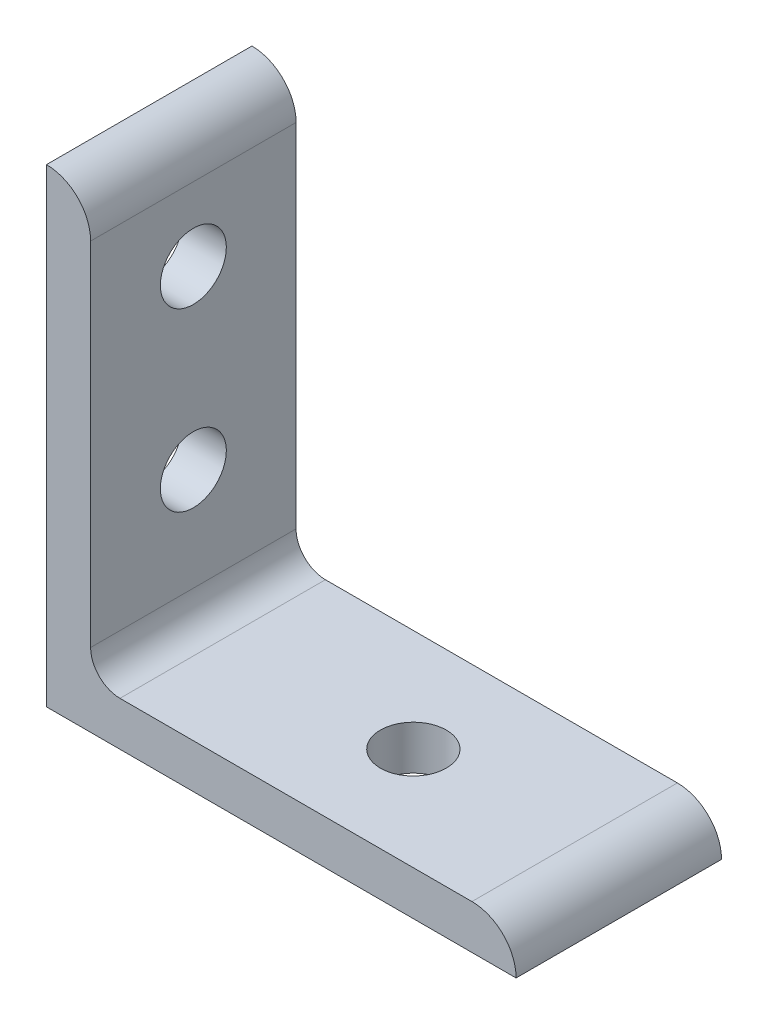
ISO-10303-21;
HEADER;
FILE_DESCRIPTION(('STEP AP214'),'2;1');
FILE_NAME('part.step','',(''),(''),'','','');
FILE_SCHEMA(('AUTOMOTIVE_DESIGN { 1 0 10303 214 1 1 1 1 }'));
ENDSEC;
DATA;
#1=APPLICATION_CONTEXT('core data for automotive mechanical design processes');
#2=APPLICATION_PROTOCOL_DEFINITION('international standard','automotive_design',2000,#1);
#3=PRODUCT_CONTEXT('',#1,'mechanical');
#4=PRODUCT('Part','Part','',(#3));
#5=PRODUCT_RELATED_PRODUCT_CATEGORY('part','',(#4));
#6=PRODUCT_DEFINITION_FORMATION('','',#4);
#7=PRODUCT_DEFINITION_CONTEXT('part definition',#1,'design');
#8=PRODUCT_DEFINITION('design','',#6,#7);
#9=PRODUCT_DEFINITION_SHAPE('','',#8);
#10=(LENGTH_UNIT() NAMED_UNIT(*) SI_UNIT(.MILLI.,.METRE.));
#11=(NAMED_UNIT(*) PLANE_ANGLE_UNIT() SI_UNIT($,.RADIAN.));
#12=(NAMED_UNIT(*) SI_UNIT($,.STERADIAN.) SOLID_ANGLE_UNIT());
#13=UNCERTAINTY_MEASURE_WITH_UNIT(LENGTH_MEASURE(1.E-05),#10,'distance_accuracy_value','');
#14=(GEOMETRIC_REPRESENTATION_CONTEXT(3) GLOBAL_UNCERTAINTY_ASSIGNED_CONTEXT((#13)) GLOBAL_UNIT_ASSIGNED_CONTEXT((#10,
#11,#12)) REPRESENTATION_CONTEXT('',''));
#15=CARTESIAN_POINT('',(0.,0.,0.));
#16=DIRECTION('',(0.,0.,1.));
#17=DIRECTION('',(1.,0.,0.));
#18=AXIS2_PLACEMENT_3D('',#15,#16,#17);
#19=CARTESIAN_POINT('',(4.7752,46.0248,11.1125));
#20=DIRECTION('',(-1.,0.,0.));
#21=DIRECTION('',(0.,-1.,0.));
#22=AXIS2_PLACEMENT_3D('',#19,#20,#21);
#23=PLANE('',#22);
#24=DIRECTION('',(0.,1.,0.));
#25=VECTOR('',#24,1.);
#26=CARTESIAN_POINT('',(4.7752,46.0248,-11.1125));
#27=LINE('',#26,#25);
#28=CARTESIAN_POINT('',(4.7752,7.9502,-11.1125));
#29=VERTEX_POINT('',#28);
#30=CARTESIAN_POINT('',(4.77519999999999,46.0248,-11.1125));
#31=VERTEX_POINT('',#30);
#32=EDGE_CURVE('E118',#29,#31,#27,.T.);
#33=ORIENTED_EDGE('',*,*,#32,.T.);
#34=DIRECTION('',(0.,0.,-1.));
#35=VECTOR('',#34,1.);
#36=CARTESIAN_POINT('',(4.77519999999999,46.0248,11.1125));
#37=LINE('',#36,#35);
#38=CARTESIAN_POINT('',(4.77519999999999,46.0248,11.1125));
#39=VERTEX_POINT('',#38);
#40=EDGE_CURVE('E115',#39,#31,#37,.T.);
#41=ORIENTED_EDGE('',*,*,#40,.F.);
#42=DIRECTION('',(0.,1.,0.));
#43=VECTOR('',#42,1.);
#44=CARTESIAN_POINT('',(4.7752,46.0248,11.1125));
#45=LINE('',#44,#43);
#46=CARTESIAN_POINT('',(4.7752,7.9502,11.1125));
#47=VERTEX_POINT('',#46);
#48=EDGE_CURVE('E104',#47,#39,#45,.T.);
#49=ORIENTED_EDGE('',*,*,#48,.F.);
#50=DIRECTION('',(0.,0.,-1.));
#51=VECTOR('',#50,1.);
#52=CARTESIAN_POINT('',(4.7752,7.9502,11.1125));
#53=LINE('',#52,#51);
#54=EDGE_CURVE('E119',#47,#29,#53,.T.);
#55=ORIENTED_EDGE('',*,*,#54,.T.);
#56=EDGE_LOOP('',(#33,#41,#49,#55));
#57=FACE_BOUND('',#56,.T.);
#58=CARTESIAN_POINT('',(4.7752,19.05,0.));
#59=DIRECTION('',(-1.,0.,0.));
#60=DIRECTION('',(0.,-1.,0.));
#61=AXIS2_PLACEMENT_3D('',#58,#59,#60);
#62=CIRCLE('',#61,3.5687);
#63=CARTESIAN_POINT('',(4.7752,15.4813,0.));
#64=VERTEX_POINT('',#63);
#65=EDGE_CURVE('E168',#64,#64,#62,.F.);
#66=ORIENTED_EDGE('',*,*,#65,.F.);
#67=EDGE_LOOP('',(#66));
#68=FACE_BOUND('',#67,.T.);
#69=CARTESIAN_POINT('',(4.77519999999999,38.1,0.));
#70=DIRECTION('',(-1.,0.,0.));
#71=DIRECTION('',(0.,-1.,0.));
#72=AXIS2_PLACEMENT_3D('',#69,#70,#71);
#73=CIRCLE('',#72,3.5687);
#74=CARTESIAN_POINT('',(4.77519999999999,34.5313,0.));
#75=VERTEX_POINT('',#74);
#76=EDGE_CURVE('E174',#75,#75,#73,.F.);
#77=ORIENTED_EDGE('',*,*,#76,.F.);
#78=EDGE_LOOP('',(#77));
#79=FACE_BOUND('',#78,.T.);
#80=ADVANCED_FACE('F36',(#57,#68,#79),#23,.F.);
#81=CARTESIAN_POINT('',(0.,0.,11.1125));
#82=DIRECTION('',(1.,0.,0.));
#83=DIRECTION('',(0.,0.,-1.));
#84=AXIS2_PLACEMENT_3D('',#81,#82,#83);
#85=PLANE('',#84);
#86=DIRECTION('',(0.,-1.,0.));
#87=VECTOR('',#86,1.);
#88=CARTESIAN_POINT('',(0.,0.,-11.1125));
#89=LINE('',#88,#87);
#90=CARTESIAN_POINT('',(0.,50.8,-11.1125));
#91=VERTEX_POINT('',#90);
#92=CARTESIAN_POINT('',(0.,0.,-11.1125));
#93=VERTEX_POINT('',#92);
#94=EDGE_CURVE('E86',#91,#93,#89,.T.);
#95=ORIENTED_EDGE('',*,*,#94,.T.);
#96=DIRECTION('',(0.,0.,-1.));
#97=VECTOR('',#96,1.);
#98=CARTESIAN_POINT('',(0.,0.,11.1125));
#99=LINE('',#98,#97);
#100=CARTESIAN_POINT('',(0.,0.,11.1125));
#101=VERTEX_POINT('',#100);
#102=EDGE_CURVE('E124',#101,#93,#99,.T.);
#103=ORIENTED_EDGE('',*,*,#102,.F.);
#104=DIRECTION('',(0.,-1.,0.));
#105=VECTOR('',#104,1.);
#106=CARTESIAN_POINT('',(0.,0.,11.1125));
#107=LINE('',#106,#105);
#108=CARTESIAN_POINT('',(0.,50.8,11.1125));
#109=VERTEX_POINT('',#108);
#110=EDGE_CURVE('E54',#109,#101,#107,.T.);
#111=ORIENTED_EDGE('',*,*,#110,.F.);
#112=DIRECTION('',(0.,0.,-1.));
#113=VECTOR('',#112,1.);
#114=CARTESIAN_POINT('',(0.,50.8,11.1125));
#115=LINE('',#114,#113);
#116=EDGE_CURVE('E120',#109,#91,#115,.T.);
#117=ORIENTED_EDGE('',*,*,#116,.T.);
#118=EDGE_LOOP('',(#95,#103,#111,#117));
#119=FACE_BOUND('',#118,.T.);
#120=CARTESIAN_POINT('',(0.,19.05,0.));
#121=DIRECTION('',(1.,0.,0.));
#122=DIRECTION('',(0.,0.,-1.));
#123=AXIS2_PLACEMENT_3D('',#120,#121,#122);
#124=CIRCLE('',#123,3.5687);
#125=CARTESIAN_POINT('',(0.,19.05,-3.5687));
#126=VERTEX_POINT('',#125);
#127=EDGE_CURVE('E171',#126,#126,#124,.T.);
#128=ORIENTED_EDGE('',*,*,#127,.T.);
#129=EDGE_LOOP('',(#128));
#130=FACE_BOUND('',#129,.T.);
#131=CARTESIAN_POINT('',(0.,38.1,0.));
#132=DIRECTION('',(1.,0.,0.));
#133=DIRECTION('',(0.,0.,-1.));
#134=AXIS2_PLACEMENT_3D('',#131,#132,#133);
#135=CIRCLE('',#134,3.5687);
#136=CARTESIAN_POINT('',(0.,38.1,-3.5687));
#137=VERTEX_POINT('',#136);
#138=EDGE_CURVE('E177',#137,#137,#135,.T.);
#139=ORIENTED_EDGE('',*,*,#138,.T.);
#140=EDGE_LOOP('',(#139));
#141=FACE_BOUND('',#140,.T.);
#142=ADVANCED_FACE('F181',(#119,#130,#141),#85,.F.);
#143=CARTESIAN_POINT('',(50.8,0.,11.1125));
#144=DIRECTION('',(0.,1.,0.));
#145=DIRECTION('',(-1.,0.,0.));
#146=AXIS2_PLACEMENT_3D('',#143,#144,#145);
#147=PLANE('',#146);
#148=DIRECTION('',(1.,0.,0.));
#149=VECTOR('',#148,1.);
#150=CARTESIAN_POINT('',(50.8,0.,-11.1125));
#151=LINE('',#150,#149);
#152=CARTESIAN_POINT('',(50.8,0.,-11.1125));
#153=VERTEX_POINT('',#152);
#154=EDGE_CURVE('E128',#93,#153,#151,.T.);
#155=ORIENTED_EDGE('',*,*,#154,.T.);
#156=DIRECTION('',(0.,0.,-1.));
#157=VECTOR('',#156,1.);
#158=CARTESIAN_POINT('',(50.8,0.,11.1125));
#159=LINE('',#158,#157);
#160=CARTESIAN_POINT('',(50.8,0.,11.1125));
#161=VERTEX_POINT('',#160);
#162=EDGE_CURVE('E11',#161,#153,#159,.T.);
#163=ORIENTED_EDGE('',*,*,#162,.F.);
#164=DIRECTION('',(1.,0.,0.));
#165=VECTOR('',#164,1.);
#166=CARTESIAN_POINT('',(50.8,0.,11.1125));
#167=LINE('',#166,#165);
#168=EDGE_CURVE('E140',#101,#161,#167,.T.);
#169=ORIENTED_EDGE('',*,*,#168,.F.);
#170=ORIENTED_EDGE('',*,*,#102,.T.);
#171=EDGE_LOOP('',(#155,#163,#169,#170));
#172=FACE_BOUND('',#171,.T.);
#173=CARTESIAN_POINT('',(28.575,0.,0.));
#174=DIRECTION('',(0.,1.,0.));
#175=DIRECTION('',(0.,0.,1.));
#176=AXIS2_PLACEMENT_3D('',#173,#174,#175);
#177=CIRCLE('',#176,3.5687);
#178=CARTESIAN_POINT('',(28.575,0.,3.5687));
#179=VERTEX_POINT('',#178);
#180=EDGE_CURVE('E165',#179,#179,#177,.T.);
#181=ORIENTED_EDGE('',*,*,#180,.T.);
#182=EDGE_LOOP('',(#181));
#183=FACE_BOUND('',#182,.T.);
#184=ADVANCED_FACE('F38',(#172,#183),#147,.F.);
#185=CARTESIAN_POINT('',(7.9502,4.7752,11.1125));
#186=DIRECTION('',(0.,-1.,0.));
#187=DIRECTION('',(1.,0.,0.));
#188=AXIS2_PLACEMENT_3D('',#185,#186,#187);
#189=PLANE('',#188);
#190=DIRECTION('',(-1.,0.,0.));
#191=VECTOR('',#190,1.);
#192=CARTESIAN_POINT('',(7.9502,4.7752,-11.1125));
#193=LINE('',#192,#191);
#194=CARTESIAN_POINT('',(46.0248,4.7752,-11.1125));
#195=VERTEX_POINT('',#194);
#196=CARTESIAN_POINT('',(7.9502,4.7752,-11.1125));
#197=VERTEX_POINT('',#196);
#198=EDGE_CURVE('E133',#195,#197,#193,.T.);
#199=ORIENTED_EDGE('',*,*,#198,.T.);
#200=DIRECTION('',(0.,0.,-1.));
#201=VECTOR('',#200,1.);
#202=CARTESIAN_POINT('',(7.9502,4.7752,11.1125));
#203=LINE('',#202,#201);
#204=CARTESIAN_POINT('',(7.9502,4.7752,11.1125));
#205=VERTEX_POINT('',#204);
#206=EDGE_CURVE('E144',#205,#197,#203,.T.);
#207=ORIENTED_EDGE('',*,*,#206,.F.);
#208=DIRECTION('',(-1.,0.,0.));
#209=VECTOR('',#208,1.);
#210=CARTESIAN_POINT('',(7.9502,4.7752,11.1125));
#211=LINE('',#210,#209);
#212=CARTESIAN_POINT('',(46.0248,4.7752,11.1125));
#213=VERTEX_POINT('',#212);
#214=EDGE_CURVE('E154',#213,#205,#211,.T.);
#215=ORIENTED_EDGE('',*,*,#214,.F.);
#216=DIRECTION('',(0.,0.,-1.));
#217=VECTOR('',#216,1.);
#218=CARTESIAN_POINT('',(46.0248,4.7752,11.1125));
#219=LINE('',#218,#217);
#220=EDGE_CURVE('E46',#213,#195,#219,.T.);
#221=ORIENTED_EDGE('',*,*,#220,.T.);
#222=EDGE_LOOP('',(#199,#207,#215,#221));
#223=FACE_BOUND('',#222,.T.);
#224=CARTESIAN_POINT('',(28.575,4.7752,0.));
#225=DIRECTION('',(0.,-1.,0.));
#226=DIRECTION('',(1.,0.,0.));
#227=AXIS2_PLACEMENT_3D('',#224,#225,#226);
#228=CIRCLE('',#227,3.5687);
#229=CARTESIAN_POINT('',(32.1437,4.7752,0.));
#230=VERTEX_POINT('',#229);
#231=EDGE_CURVE('E40',#230,#230,#228,.F.);
#232=ORIENTED_EDGE('',*,*,#231,.F.);
#233=EDGE_LOOP('',(#232));
#234=FACE_BOUND('',#233,.T.);
#235=ADVANCED_FACE('F151',(#223,#234),#189,.F.);
#236=CARTESIAN_POINT('',(46.0248,0.,11.1125));
#237=DIRECTION('',(0.,0.,-1.));
#238=DIRECTION('',(-1.,0.,0.));
#239=AXIS2_PLACEMENT_3D('',#236,#237,#238);
#240=CYLINDRICAL_SURFACE('',#239,4.7752);
#241=CARTESIAN_POINT('',(46.0248,0.,-11.1125));
#242=DIRECTION('',(0.,0.,1.));
#243=DIRECTION('',(1.,0.,0.));
#244=AXIS2_PLACEMENT_3D('',#241,#242,#243);
#245=CIRCLE('',#244,4.7752);
#246=EDGE_CURVE('E131',#153,#195,#245,.T.);
#247=ORIENTED_EDGE('',*,*,#246,.T.);
#248=ORIENTED_EDGE('',*,*,#220,.F.);
#249=CARTESIAN_POINT('',(46.0248,0.,11.1125));
#250=DIRECTION('',(0.,0.,1.));
#251=DIRECTION('',(1.,0.,0.));
#252=AXIS2_PLACEMENT_3D('',#249,#250,#251);
#253=CIRCLE('',#252,4.7752);
#254=EDGE_CURVE('E94',#161,#213,#253,.T.);
#255=ORIENTED_EDGE('',*,*,#254,.F.);
#256=ORIENTED_EDGE('',*,*,#162,.T.);
#257=EDGE_LOOP('',(#247,#248,#255,#256));
#258=FACE_BOUND('',#257,.T.);
#259=ADVANCED_FACE('F200',(#258),#240,.T.);
#260=CARTESIAN_POINT('',(7.9502,7.9502,11.1125));
#261=DIRECTION('',(0.,0.,-1.));
#262=DIRECTION('',(-1.,0.,0.));
#263=AXIS2_PLACEMENT_3D('',#260,#261,#262);
#264=CYLINDRICAL_SURFACE('',#263,3.175);
#265=CARTESIAN_POINT('',(7.9502,7.9502,-11.1125));
#266=DIRECTION('',(0.,0.,-1.));
#267=DIRECTION('',(1.,0.,0.));
#268=AXIS2_PLACEMENT_3D('',#265,#266,#267);
#269=CIRCLE('',#268,3.175);
#270=EDGE_CURVE('E135',#197,#29,#269,.T.);
#271=ORIENTED_EDGE('',*,*,#270,.T.);
#272=ORIENTED_EDGE('',*,*,#54,.F.);
#273=CARTESIAN_POINT('',(7.9502,7.9502,11.1125));
#274=DIRECTION('',(0.,0.,-1.));
#275=DIRECTION('',(1.,0.,0.));
#276=AXIS2_PLACEMENT_3D('',#273,#274,#275);
#277=CIRCLE('',#276,3.175);
#278=EDGE_CURVE('E110',#205,#47,#277,.T.);
#279=ORIENTED_EDGE('',*,*,#278,.F.);
#280=ORIENTED_EDGE('',*,*,#206,.T.);
#281=EDGE_LOOP('',(#271,#272,#279,#280));
#282=FACE_BOUND('',#281,.T.);
#283=ADVANCED_FACE('F160',(#282),#264,.F.);
#284=CARTESIAN_POINT('',(0.,46.0248,11.1125));
#285=DIRECTION('',(0.,0.,-1.));
#286=DIRECTION('',(-1.,0.,0.));
#287=AXIS2_PLACEMENT_3D('',#284,#285,#286);
#288=CYLINDRICAL_SURFACE('',#287,4.77519999999999);
#289=CARTESIAN_POINT('',(0.,46.0248,-11.1125));
#290=DIRECTION('',(0.,0.,1.));
#291=DIRECTION('',(1.,0.,0.));
#292=AXIS2_PLACEMENT_3D('',#289,#290,#291);
#293=CIRCLE('',#292,4.77519999999999);
#294=EDGE_CURVE('E80',#31,#91,#293,.T.);
#295=ORIENTED_EDGE('',*,*,#294,.T.);
#296=ORIENTED_EDGE('',*,*,#116,.F.);
#297=CARTESIAN_POINT('',(0.,46.0248,11.1125));
#298=DIRECTION('',(0.,0.,1.));
#299=DIRECTION('',(1.,0.,0.));
#300=AXIS2_PLACEMENT_3D('',#297,#298,#299);
#301=CIRCLE('',#300,4.77519999999999);
#302=EDGE_CURVE('E108',#39,#109,#301,.T.);
#303=ORIENTED_EDGE('',*,*,#302,.F.);
#304=ORIENTED_EDGE('',*,*,#40,.T.);
#305=EDGE_LOOP('',(#295,#296,#303,#304));
#306=FACE_BOUND('',#305,.T.);
#307=ADVANCED_FACE('F122',(#306),#288,.T.);
#308=CARTESIAN_POINT('',(0.,46.0248,11.1125));
#309=DIRECTION('',(0.,0.,1.));
#310=DIRECTION('',(1.,0.,0.));
#311=AXIS2_PLACEMENT_3D('',#308,#309,#310);
#312=PLANE('',#311);
#313=ORIENTED_EDGE('',*,*,#168,.T.);
#314=ORIENTED_EDGE('',*,*,#254,.T.);
#315=ORIENTED_EDGE('',*,*,#214,.T.);
#316=ORIENTED_EDGE('',*,*,#278,.T.);
#317=ORIENTED_EDGE('',*,*,#48,.T.);
#318=ORIENTED_EDGE('',*,*,#302,.T.);
#319=ORIENTED_EDGE('',*,*,#110,.T.);
#320=EDGE_LOOP('',(#313,#314,#315,#316,#317,#318,#319));
#321=FACE_BOUND('',#320,.T.);
#322=ADVANCED_FACE('F106',(#321),#312,.T.);
#323=CARTESIAN_POINT('',(0.,46.0248,-11.1125));
#324=DIRECTION('',(0.,0.,1.));
#325=DIRECTION('',(1.,0.,0.));
#326=AXIS2_PLACEMENT_3D('',#323,#324,#325);
#327=PLANE('',#326);
#328=ORIENTED_EDGE('',*,*,#154,.F.);
#329=ORIENTED_EDGE('',*,*,#94,.F.);
#330=ORIENTED_EDGE('',*,*,#294,.F.);
#331=ORIENTED_EDGE('',*,*,#32,.F.);
#332=ORIENTED_EDGE('',*,*,#270,.F.);
#333=ORIENTED_EDGE('',*,*,#198,.F.);
#334=ORIENTED_EDGE('',*,*,#246,.F.);
#335=EDGE_LOOP('',(#328,#329,#330,#331,#332,#333,#334));
#336=FACE_BOUND('',#335,.T.);
#337=ADVANCED_FACE('F158',(#336),#327,.F.);
#338=CARTESIAN_POINT('',(28.575,50.8,0.));
#339=DIRECTION('',(0.,-1.,0.));
#340=DIRECTION('',(0.,0.,-1.));
#341=AXIS2_PLACEMENT_3D('',#338,#339,#340);
#342=CYLINDRICAL_SURFACE('',#341,3.5687);
#343=ORIENTED_EDGE('',*,*,#180,.F.);
#344=EDGE_LOOP('',(#343));
#345=FACE_BOUND('',#344,.T.);
#346=ORIENTED_EDGE('',*,*,#231,.T.);
#347=EDGE_LOOP('',(#346));
#348=FACE_BOUND('',#347,.T.);
#349=ADVANCED_FACE('F214',(#345,#348),#342,.F.);
#350=CARTESIAN_POINT('',(50.8,19.05,0.));
#351=DIRECTION('',(-1.,0.,0.));
#352=DIRECTION('',(0.,0.,1.));
#353=AXIS2_PLACEMENT_3D('',#350,#351,#352);
#354=CYLINDRICAL_SURFACE('',#353,3.5687);
#355=ORIENTED_EDGE('',*,*,#127,.F.);
#356=EDGE_LOOP('',(#355));
#357=FACE_BOUND('',#356,.T.);
#358=ORIENTED_EDGE('',*,*,#65,.T.);
#359=EDGE_LOOP('',(#358));
#360=FACE_BOUND('',#359,.T.);
#361=ADVANCED_FACE('F186',(#357,#360),#354,.F.);
#362=CARTESIAN_POINT('',(50.8,38.1,0.));
#363=DIRECTION('',(-1.,0.,0.));
#364=DIRECTION('',(0.,0.,1.));
#365=AXIS2_PLACEMENT_3D('',#362,#363,#364);
#366=CYLINDRICAL_SURFACE('',#365,3.5687);
#367=ORIENTED_EDGE('',*,*,#138,.F.);
#368=EDGE_LOOP('',(#367));
#369=FACE_BOUND('',#368,.T.);
#370=ORIENTED_EDGE('',*,*,#76,.T.);
#371=EDGE_LOOP('',(#370));
#372=FACE_BOUND('',#371,.T.);
#373=ADVANCED_FACE('F183',(#369,#372),#366,.F.);
#374=CLOSED_SHELL('',(#80,#142,#184,#235,#259,#283,#307,#322,#337,#349,#361,#373));
#375=MANIFOLD_SOLID_BREP('B2',#374);
#376=ADVANCED_BREP_SHAPE_REPRESENTATION('',(#18,#375),#14);
#377=SHAPE_DEFINITION_REPRESENTATION(#9,#376);
ENDSEC;
END-ISO-10303-21;
